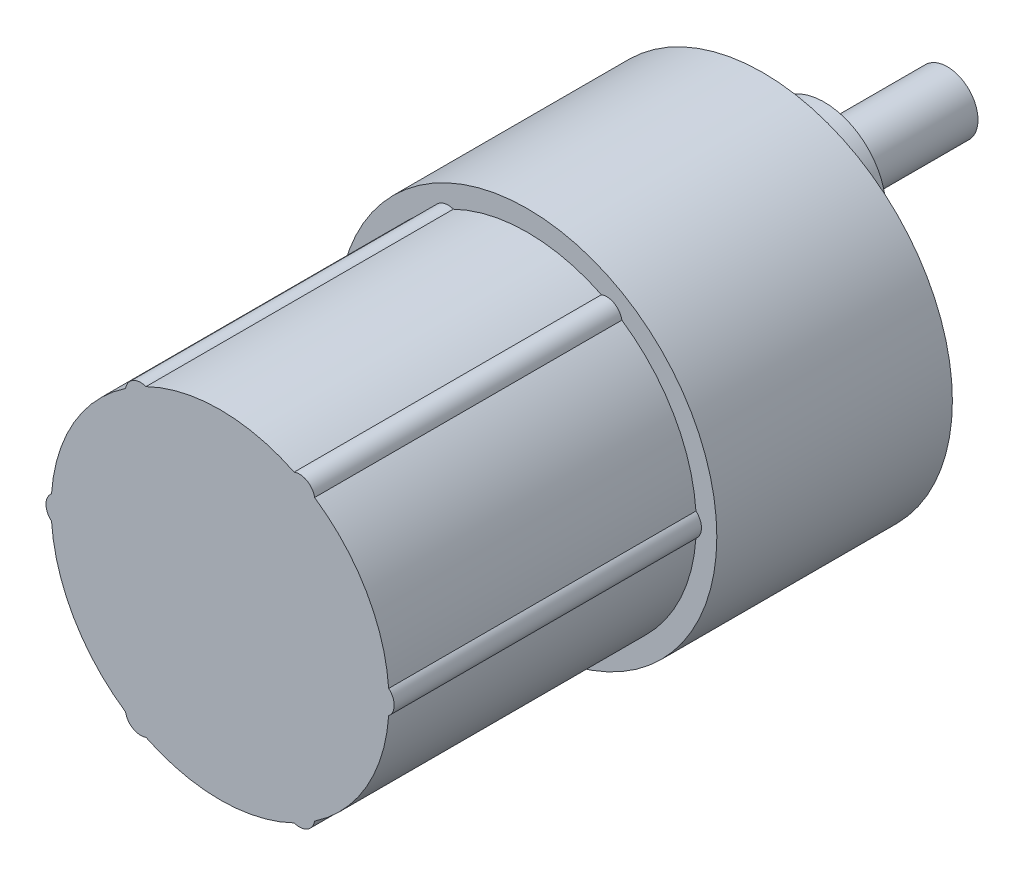
ISO-10303-21;
HEADER;
FILE_DESCRIPTION(('STEP AP214'),'2;1');
FILE_NAME('part.step','',(''),(''),'','','');
FILE_SCHEMA(('AUTOMOTIVE_DESIGN { 1 0 10303 214 1 1 1 1 }'));
ENDSEC;
DATA;
#1=APPLICATION_CONTEXT('core data for automotive mechanical design processes');
#2=APPLICATION_PROTOCOL_DEFINITION('international standard','automotive_design',2000,#1);
#3=PRODUCT_CONTEXT('',#1,'mechanical');
#4=PRODUCT('Part','Part','',(#3));
#5=PRODUCT_RELATED_PRODUCT_CATEGORY('part','',(#4));
#6=PRODUCT_DEFINITION_FORMATION('','',#4);
#7=PRODUCT_DEFINITION_CONTEXT('part definition',#1,'design');
#8=PRODUCT_DEFINITION('design','',#6,#7);
#9=PRODUCT_DEFINITION_SHAPE('','',#8);
#10=(LENGTH_UNIT() NAMED_UNIT(*) SI_UNIT(.MILLI.,.METRE.));
#11=(NAMED_UNIT(*) PLANE_ANGLE_UNIT() SI_UNIT($,.RADIAN.));
#12=(NAMED_UNIT(*) SI_UNIT($,.STERADIAN.) SOLID_ANGLE_UNIT());
#13=UNCERTAINTY_MEASURE_WITH_UNIT(LENGTH_MEASURE(1.E-05),#10,'distance_accuracy_value','');
#14=(GEOMETRIC_REPRESENTATION_CONTEXT(3) GLOBAL_UNCERTAINTY_ASSIGNED_CONTEXT((#13)) GLOBAL_UNIT_ASSIGNED_CONTEXT((#10,
#11,#12)) REPRESENTATION_CONTEXT('',''));
#15=CARTESIAN_POINT('',(0.,0.,0.));
#16=DIRECTION('',(0.,0.,1.));
#17=DIRECTION('',(1.,0.,0.));
#18=AXIS2_PLACEMENT_3D('',#15,#16,#17);
#19=CARTESIAN_POINT('',(0.,0.,23.));
#20=DIRECTION('',(0.,0.,1.));
#21=DIRECTION('',(1.,0.,0.));
#22=AXIS2_PLACEMENT_3D('',#19,#20,#21);
#23=PLANE('',#22);
#24=CARTESIAN_POINT('',(0.,0.,23.));
#25=DIRECTION('',(0.,0.,1.));
#26=DIRECTION('',(1.,0.,0.));
#27=AXIS2_PLACEMENT_3D('',#24,#25,#26);
#28=CIRCLE('',#27,18.5);
#29=CARTESIAN_POINT('',(18.5,0.,23.));
#30=VERTEX_POINT('',#29);
#31=EDGE_CURVE('E12',#30,#30,#28,.T.);
#32=ORIENTED_EDGE('',*,*,#31,.T.);
#33=EDGE_LOOP('',(#32));
#34=FACE_BOUND('',#33,.T.);
#35=CARTESIAN_POINT('',(15.5,-1.08235921504137E-13,23.));
#36=DIRECTION('',(0.,0.,1.));
#37=DIRECTION('',(1.,0.,0.));
#38=AXIS2_PLACEMENT_3D('',#35,#36,#37);
#39=CIRCLE('',#38,1.5);
#40=CARTESIAN_POINT('',(16.4596774193548,1.15283097233731,23.));
#41=VERTEX_POINT('',#40);
#42=CARTESIAN_POINT('',(16.4596774193548,-1.15283097233755,23.));
#43=VERTEX_POINT('',#42);
#44=EDGE_CURVE('E225',#41,#43,#39,.F.);
#45=ORIENTED_EDGE('',*,*,#44,.T.);
#46=CARTESIAN_POINT('',(0.,0.,23.));
#47=DIRECTION('',(0.,0.,1.));
#48=DIRECTION('',(1.,0.,0.));
#49=AXIS2_PLACEMENT_3D('',#46,#47,#48);
#50=CIRCLE('',#49,16.5);
#51=CARTESIAN_POINT('',(9.22821961799101,-13.6780832970898,23.));
#52=VERTEX_POINT('',#51);
#53=EDGE_CURVE('E106',#43,#52,#50,.F.);
#54=ORIENTED_EDGE('',*,*,#53,.T.);
#55=CARTESIAN_POINT('',(7.74999999999987,-13.4233937586589,23.));
#56=DIRECTION('',(0.,0.,1.));
#57=DIRECTION('',(1.,0.,0.));
#58=AXIS2_PLACEMENT_3D('',#55,#56,#57);
#59=CIRCLE('',#58,1.5);
#60=CARTESIAN_POINT('',(7.23145780136356,-14.8309142694272,23.));
#61=VERTEX_POINT('',#60);
#62=EDGE_CURVE('E99',#61,#52,#59,.T.);
#63=ORIENTED_EDGE('',*,*,#62,.F.);
#64=CARTESIAN_POINT('',(0.,0.,23.));
#65=DIRECTION('',(0.,0.,1.));
#66=DIRECTION('',(1.,0.,0.));
#67=AXIS2_PLACEMENT_3D('',#64,#65,#66);
#68=CIRCLE('',#67,16.5);
#69=CARTESIAN_POINT('',(-7.23145780136389,-14.830914269427,23.));
#70=VERTEX_POINT('',#69);
#71=EDGE_CURVE('E227',#61,#70,#68,.F.);
#72=ORIENTED_EDGE('',*,*,#71,.T.);
#73=CARTESIAN_POINT('',(-7.75000000000016,-13.4233937586587,23.));
#74=DIRECTION('',(0.,0.,1.));
#75=DIRECTION('',(1.,0.,0.));
#76=AXIS2_PLACEMENT_3D('',#73,#74,#75);
#77=CIRCLE('',#76,1.5);
#78=CARTESIAN_POINT('',(-9.2282196179913,-13.6780832970896,23.));
#79=VERTEX_POINT('',#78);
#80=EDGE_CURVE('E249',#79,#70,#77,.T.);
#81=ORIENTED_EDGE('',*,*,#80,.F.);
#82=CARTESIAN_POINT('',(0.,0.,23.));
#83=DIRECTION('',(0.,0.,1.));
#84=DIRECTION('',(1.,0.,0.));
#85=AXIS2_PLACEMENT_3D('',#82,#83,#84);
#86=CIRCLE('',#85,16.5);
#87=CARTESIAN_POINT('',(-16.4596774193548,-1.15283097233742,23.));
#88=VERTEX_POINT('',#87);
#89=EDGE_CURVE('E229',#79,#88,#86,.F.);
#90=ORIENTED_EDGE('',*,*,#89,.T.);
#91=CARTESIAN_POINT('',(-15.5,0.,23.));
#92=DIRECTION('',(0.,0.,1.));
#93=DIRECTION('',(1.,0.,0.));
#94=AXIS2_PLACEMENT_3D('',#91,#92,#93);
#95=CIRCLE('',#94,1.5);
#96=CARTESIAN_POINT('',(-16.4596774193548,1.15283097233743,23.));
#97=VERTEX_POINT('',#96);
#98=EDGE_CURVE('E252',#97,#88,#95,.T.);
#99=ORIENTED_EDGE('',*,*,#98,.F.);
#100=CARTESIAN_POINT('',(0.,0.,23.));
#101=DIRECTION('',(0.,0.,1.));
#102=DIRECTION('',(1.,0.,0.));
#103=AXIS2_PLACEMENT_3D('',#100,#101,#102);
#104=CIRCLE('',#103,16.5);
#105=CARTESIAN_POINT('',(-9.22821961799111,13.6780832970897,23.));
#106=VERTEX_POINT('',#105);
#107=EDGE_CURVE('E231',#97,#106,#104,.F.);
#108=ORIENTED_EDGE('',*,*,#107,.T.);
#109=CARTESIAN_POINT('',(-7.74999999999997,13.4233937586588,23.));
#110=DIRECTION('',(0.,0.,1.));
#111=DIRECTION('',(1.,0.,0.));
#112=AXIS2_PLACEMENT_3D('',#109,#110,#111);
#113=CIRCLE('',#112,1.5);
#114=CARTESIAN_POINT('',(-7.23145780136368,14.8309142694271,23.));
#115=VERTEX_POINT('',#114);
#116=EDGE_CURVE('E255',#115,#106,#113,.T.);
#117=ORIENTED_EDGE('',*,*,#116,.F.);
#118=CARTESIAN_POINT('',(0.,0.,23.));
#119=DIRECTION('',(0.,0.,1.));
#120=DIRECTION('',(1.,0.,0.));
#121=AXIS2_PLACEMENT_3D('',#118,#119,#120);
#122=CIRCLE('',#121,16.5);
#123=CARTESIAN_POINT('',(7.23145780136377,14.8309142694271,23.));
#124=VERTEX_POINT('',#123);
#125=EDGE_CURVE('E203',#115,#124,#122,.F.);
#126=ORIENTED_EDGE('',*,*,#125,.T.);
#127=CARTESIAN_POINT('',(7.75000000000006,13.4233937586588,23.));
#128=DIRECTION('',(0.,0.,1.));
#129=DIRECTION('',(1.,0.,0.));
#130=AXIS2_PLACEMENT_3D('',#127,#128,#129);
#131=CIRCLE('',#130,1.5);
#132=CARTESIAN_POINT('',(9.22821961799121,13.6780832970896,23.));
#133=VERTEX_POINT('',#132);
#134=EDGE_CURVE('E257',#133,#124,#131,.T.);
#135=ORIENTED_EDGE('',*,*,#134,.F.);
#136=CARTESIAN_POINT('',(0.,0.,23.));
#137=DIRECTION('',(0.,0.,1.));
#138=DIRECTION('',(1.,0.,0.));
#139=AXIS2_PLACEMENT_3D('',#136,#137,#138);
#140=CIRCLE('',#139,16.5);
#141=EDGE_CURVE('E234',#133,#41,#140,.F.);
#142=ORIENTED_EDGE('',*,*,#141,.T.);
#143=EDGE_LOOP('',(#45,#54,#63,#72,#81,#90,#99,#108,#117,#126,#135,#142));
#144=FACE_BOUND('',#143,.T.);
#145=ADVANCED_FACE('F90',(#34,#144),#23,.T.);
#146=CARTESIAN_POINT('',(0.,0.,23.));
#147=DIRECTION('',(0.,0.,-1.));
#148=DIRECTION('',(-1.,0.,0.));
#149=AXIS2_PLACEMENT_3D('',#146,#147,#148);
#150=CYLINDRICAL_SURFACE('',#149,18.5);
#151=ORIENTED_EDGE('',*,*,#31,.F.);
#152=EDGE_LOOP('',(#151));
#153=FACE_BOUND('',#152,.T.);
#154=CARTESIAN_POINT('',(0.,0.,0.));
#155=DIRECTION('',(0.,0.,1.));
#156=DIRECTION('',(1.,0.,0.));
#157=AXIS2_PLACEMENT_3D('',#154,#155,#156);
#158=CIRCLE('',#157,18.5);
#159=CARTESIAN_POINT('',(18.5,0.,0.));
#160=VERTEX_POINT('',#159);
#161=EDGE_CURVE('E94',#160,#160,#158,.T.);
#162=ORIENTED_EDGE('',*,*,#161,.T.);
#163=EDGE_LOOP('',(#162));
#164=FACE_BOUND('',#163,.T.);
#165=ADVANCED_FACE('F92',(#153,#164),#150,.T.);
#166=CARTESIAN_POINT('',(0.,0.,0.));
#167=DIRECTION('',(0.,0.,1.));
#168=DIRECTION('',(1.,0.,0.));
#169=AXIS2_PLACEMENT_3D('',#166,#167,#168);
#170=PLANE('',#169);
#171=CARTESIAN_POINT('',(7.75000000000006,13.4233937586588,0.));
#172=DIRECTION('',(0.,0.,1.));
#173=DIRECTION('',(1.,0.,0.));
#174=AXIS2_PLACEMENT_3D('',#171,#172,#173);
#175=CIRCLE('',#174,1.5);
#176=CARTESIAN_POINT('',(9.25000000000006,13.4233937586588,0.));
#177=VERTEX_POINT('',#176);
#178=EDGE_CURVE('E354',#177,#177,#175,.T.);
#179=ORIENTED_EDGE('',*,*,#178,.T.);
#180=EDGE_LOOP('',(#179));
#181=FACE_BOUND('',#180,.T.);
#182=CARTESIAN_POINT('',(-7.74999999999997,13.4233937586588,0.));
#183=DIRECTION('',(0.,0.,1.));
#184=DIRECTION('',(1.,0.,0.));
#185=AXIS2_PLACEMENT_3D('',#182,#183,#184);
#186=CIRCLE('',#185,1.5);
#187=CARTESIAN_POINT('',(-6.24999999999997,13.4233937586588,0.));
#188=VERTEX_POINT('',#187);
#189=EDGE_CURVE('E358',#188,#188,#186,.T.);
#190=ORIENTED_EDGE('',*,*,#189,.T.);
#191=EDGE_LOOP('',(#190));
#192=FACE_BOUND('',#191,.T.);
#193=CARTESIAN_POINT('',(7.74999999999987,-13.4233937586589,0.));
#194=DIRECTION('',(0.,0.,1.));
#195=DIRECTION('',(1.,0.,0.));
#196=AXIS2_PLACEMENT_3D('',#193,#194,#195);
#197=CIRCLE('',#196,1.5);
#198=CARTESIAN_POINT('',(9.24999999999988,-13.4233937586589,0.));
#199=VERTEX_POINT('',#198);
#200=EDGE_CURVE('E362',#199,#199,#197,.T.);
#201=ORIENTED_EDGE('',*,*,#200,.T.);
#202=EDGE_LOOP('',(#201));
#203=FACE_BOUND('',#202,.T.);
#204=CARTESIAN_POINT('',(-15.5,0.,0.));
#205=DIRECTION('',(0.,0.,1.));
#206=DIRECTION('',(1.,0.,0.));
#207=AXIS2_PLACEMENT_3D('',#204,#205,#206);
#208=CIRCLE('',#207,1.5);
#209=CARTESIAN_POINT('',(-14.,0.,0.));
#210=VERTEX_POINT('',#209);
#211=EDGE_CURVE('E366',#210,#210,#208,.T.);
#212=ORIENTED_EDGE('',*,*,#211,.T.);
#213=EDGE_LOOP('',(#212));
#214=FACE_BOUND('',#213,.T.);
#215=CARTESIAN_POINT('',(-7.75000000000016,-13.4233937586587,0.));
#216=DIRECTION('',(0.,0.,1.));
#217=DIRECTION('',(1.,0.,0.));
#218=AXIS2_PLACEMENT_3D('',#215,#216,#217);
#219=CIRCLE('',#218,1.5);
#220=CARTESIAN_POINT('',(-6.25000000000015,-13.4233937586587,0.));
#221=VERTEX_POINT('',#220);
#222=EDGE_CURVE('E370',#221,#221,#219,.T.);
#223=ORIENTED_EDGE('',*,*,#222,.T.);
#224=EDGE_LOOP('',(#223));
#225=FACE_BOUND('',#224,.T.);
#226=CARTESIAN_POINT('',(15.5,-1.08235921504137E-13,0.));
#227=DIRECTION('',(0.,0.,1.));
#228=DIRECTION('',(1.,0.,0.));
#229=AXIS2_PLACEMENT_3D('',#226,#227,#228);
#230=CIRCLE('',#229,1.5);
#231=CARTESIAN_POINT('',(17.,-1.08235921504137E-13,0.));
#232=VERTEX_POINT('',#231);
#233=EDGE_CURVE('E374',#232,#232,#230,.T.);
#234=ORIENTED_EDGE('',*,*,#233,.T.);
#235=EDGE_LOOP('',(#234));
#236=FACE_BOUND('',#235,.T.);
#237=CARTESIAN_POINT('',(0.,7.,0.));
#238=DIRECTION('',(0.,0.,1.));
#239=DIRECTION('',(1.,0.,0.));
#240=AXIS2_PLACEMENT_3D('',#237,#238,#239);
#241=CIRCLE('',#240,6.);
#242=CARTESIAN_POINT('',(6.,7.,0.));
#243=VERTEX_POINT('',#242);
#244=EDGE_CURVE('E243',#243,#243,#241,.T.);
#245=ORIENTED_EDGE('',*,*,#244,.T.);
#246=EDGE_LOOP('',(#245));
#247=FACE_BOUND('',#246,.T.);
#248=ORIENTED_EDGE('',*,*,#161,.F.);
#249=EDGE_LOOP('',(#248));
#250=FACE_BOUND('',#249,.T.);
#251=ADVANCED_FACE('F339',(#181,#192,#203,#214,#225,#236,#247,#250),#170,.F.);
#252=CARTESIAN_POINT('',(0.,7.,-6.));
#253=DIRECTION('',(0.,0.,1.));
#254=DIRECTION('',(1.,0.,0.));
#255=AXIS2_PLACEMENT_3D('',#252,#253,#254);
#256=CYLINDRICAL_SURFACE('',#255,6.);
#257=CARTESIAN_POINT('',(0.,7.,-6.));
#258=DIRECTION('',(0.,0.,1.));
#259=DIRECTION('',(1.,0.,0.));
#260=AXIS2_PLACEMENT_3D('',#257,#258,#259);
#261=CIRCLE('',#260,6.);
#262=CARTESIAN_POINT('',(6.,7.,-6.));
#263=VERTEX_POINT('',#262);
#264=EDGE_CURVE('E244',#263,#263,#261,.T.);
#265=ORIENTED_EDGE('',*,*,#264,.T.);
#266=EDGE_LOOP('',(#265));
#267=FACE_BOUND('',#266,.T.);
#268=ORIENTED_EDGE('',*,*,#244,.F.);
#269=EDGE_LOOP('',(#268));
#270=FACE_BOUND('',#269,.T.);
#271=ADVANCED_FACE('F342',(#267,#270),#256,.T.);
#272=CARTESIAN_POINT('',(0.,0.,-6.));
#273=DIRECTION('',(0.,0.,1.));
#274=DIRECTION('',(1.,0.,0.));
#275=AXIS2_PLACEMENT_3D('',#272,#273,#274);
#276=PLANE('',#275);
#277=CARTESIAN_POINT('',(0.,7.,-6.));
#278=DIRECTION('',(0.,0.,1.));
#279=DIRECTION('',(1.,0.,0.));
#280=AXIS2_PLACEMENT_3D('',#277,#278,#279);
#281=CIRCLE('',#280,3.);
#282=CARTESIAN_POINT('',(3.,7.,-6.));
#283=VERTEX_POINT('',#282);
#284=EDGE_CURVE('E240',#283,#283,#281,.T.);
#285=ORIENTED_EDGE('',*,*,#284,.T.);
#286=EDGE_LOOP('',(#285));
#287=FACE_BOUND('',#286,.T.);
#288=ORIENTED_EDGE('',*,*,#264,.F.);
#289=EDGE_LOOP('',(#288));
#290=FACE_BOUND('',#289,.T.);
#291=ADVANCED_FACE('F349',(#287,#290),#276,.F.);
#292=CARTESIAN_POINT('',(0.,7.,-18.));
#293=DIRECTION('',(0.,0.,1.));
#294=DIRECTION('',(1.,0.,0.));
#295=AXIS2_PLACEMENT_3D('',#292,#293,#294);
#296=CYLINDRICAL_SURFACE('',#295,3.);
#297=CARTESIAN_POINT('',(0.,7.,-18.));
#298=DIRECTION('',(0.,0.,1.));
#299=DIRECTION('',(1.,0.,0.));
#300=AXIS2_PLACEMENT_3D('',#297,#298,#299);
#301=CIRCLE('',#300,3.);
#302=CARTESIAN_POINT('',(3.,7.,-18.));
#303=VERTEX_POINT('',#302);
#304=EDGE_CURVE('E237',#303,#303,#301,.T.);
#305=ORIENTED_EDGE('',*,*,#304,.T.);
#306=EDGE_LOOP('',(#305));
#307=FACE_BOUND('',#306,.T.);
#308=ORIENTED_EDGE('',*,*,#284,.F.);
#309=EDGE_LOOP('',(#308));
#310=FACE_BOUND('',#309,.T.);
#311=ADVANCED_FACE('F679',(#307,#310),#296,.T.);
#312=CARTESIAN_POINT('',(0.,0.,-18.));
#313=DIRECTION('',(0.,0.,1.));
#314=DIRECTION('',(1.,0.,0.));
#315=AXIS2_PLACEMENT_3D('',#312,#313,#314);
#316=PLANE('',#315);
#317=ORIENTED_EDGE('',*,*,#304,.F.);
#318=EDGE_LOOP('',(#317));
#319=FACE_BOUND('',#318,.T.);
#320=ADVANCED_FACE('F462',(#319),#316,.F.);
#321=CARTESIAN_POINT('',(7.74999999999987,-13.4233937586589,53.));
#322=DIRECTION('',(0.,0.,-1.));
#323=DIRECTION('',(-1.,0.,0.));
#324=AXIS2_PLACEMENT_3D('',#321,#322,#323);
#325=CYLINDRICAL_SURFACE('',#324,1.5);
#326=ORIENTED_EDGE('',*,*,#62,.T.);
#327=DIRECTION('',(0.,0.,-1.));
#328=VECTOR('',#327,1.);
#329=CARTESIAN_POINT('',(9.22821961799103,-13.6780832970897,53.));
#330=LINE('',#329,#328);
#331=CARTESIAN_POINT('',(9.22821961799103,-13.6780832970897,53.));
#332=VERTEX_POINT('',#331);
#333=EDGE_CURVE('E266',#332,#52,#330,.T.);
#334=ORIENTED_EDGE('',*,*,#333,.F.);
#335=CARTESIAN_POINT('',(7.74999999999987,-13.4233937586589,53.));
#336=DIRECTION('',(0.,0.,1.));
#337=DIRECTION('',(1.,0.,0.));
#338=AXIS2_PLACEMENT_3D('',#335,#336,#337);
#339=CIRCLE('',#338,1.5);
#340=CARTESIAN_POINT('',(7.23145780136354,-14.8309142694272,53.));
#341=VERTEX_POINT('',#340);
#342=EDGE_CURVE('E304',#341,#332,#339,.T.);
#343=ORIENTED_EDGE('',*,*,#342,.F.);
#344=DIRECTION('',(0.,0.,-1.));
#345=VECTOR('',#344,1.);
#346=CARTESIAN_POINT('',(7.23145780136354,-14.8309142694272,53.));
#347=LINE('',#346,#345);
#348=EDGE_CURVE('E269',#341,#61,#347,.T.);
#349=ORIENTED_EDGE('',*,*,#348,.T.);
#350=EDGE_LOOP('',(#326,#334,#343,#349));
#351=FACE_BOUND('',#350,.T.);
#352=ADVANCED_FACE('F264',(#351),#325,.T.);
#353=CARTESIAN_POINT('',(0.,0.,53.));
#354=DIRECTION('',(0.,0.,-1.));
#355=DIRECTION('',(-1.,0.,0.));
#356=AXIS2_PLACEMENT_3D('',#353,#354,#355);
#357=CYLINDRICAL_SURFACE('',#356,16.5);
#358=ORIENTED_EDGE('',*,*,#53,.F.);
#359=DIRECTION('',(0.,0.,-1.));
#360=VECTOR('',#359,1.);
#361=CARTESIAN_POINT('',(16.4596774193548,-1.15283097233755,26.5));
#362=LINE('',#361,#360);
#363=CARTESIAN_POINT('',(16.4596774193548,-1.15283097233756,53.));
#364=VERTEX_POINT('',#363);
#365=EDGE_CURVE('E206',#364,#43,#362,.T.);
#366=ORIENTED_EDGE('',*,*,#365,.F.);
#367=CARTESIAN_POINT('',(0.,0.,53.));
#368=DIRECTION('',(0.,0.,1.));
#369=DIRECTION('',(1.,0.,0.));
#370=AXIS2_PLACEMENT_3D('',#367,#368,#369);
#371=CIRCLE('',#370,16.5);
#372=EDGE_CURVE('E273',#332,#364,#371,.T.);
#373=ORIENTED_EDGE('',*,*,#372,.F.);
#374=ORIENTED_EDGE('',*,*,#333,.T.);
#375=EDGE_LOOP('',(#358,#366,#373,#374));
#376=FACE_BOUND('',#375,.T.);
#377=ADVANCED_FACE('F271',(#376),#357,.T.);
#378=ORIENTED_EDGE('',*,*,#141,.F.);
#379=DIRECTION('',(0.,0.,-1.));
#380=VECTOR('',#379,1.);
#381=CARTESIAN_POINT('',(9.22821961799122,13.6780832970896,53.));
#382=LINE('',#381,#380);
#383=CARTESIAN_POINT('',(9.22821961799122,13.6780832970896,53.));
#384=VERTEX_POINT('',#383);
#385=EDGE_CURVE('E274',#384,#133,#382,.T.);
#386=ORIENTED_EDGE('',*,*,#385,.F.);
#387=CARTESIAN_POINT('',(16.4596774193548,1.15283097233733,53.));
#388=VERTEX_POINT('',#387);
#389=EDGE_CURVE('E200',#388,#384,#371,.T.);
#390=ORIENTED_EDGE('',*,*,#389,.F.);
#391=DIRECTION('',(0.,0.,-1.));
#392=VECTOR('',#391,1.);
#393=CARTESIAN_POINT('',(16.4596774193548,1.15283097233731,26.5));
#394=LINE('',#393,#392);
#395=EDGE_CURVE('E204',#41,#388,#394,.F.);
#396=ORIENTED_EDGE('',*,*,#395,.F.);
#397=EDGE_LOOP('',(#378,#386,#390,#396));
#398=FACE_BOUND('',#397,.T.);
#399=ADVANCED_FACE('F315',(#398),#357,.T.);
#400=CARTESIAN_POINT('',(7.75000000000006,13.4233937586588,53.));
#401=DIRECTION('',(0.,0.,-1.));
#402=DIRECTION('',(-1.,0.,0.));
#403=AXIS2_PLACEMENT_3D('',#400,#401,#402);
#404=CYLINDRICAL_SURFACE('',#403,1.5);
#405=ORIENTED_EDGE('',*,*,#134,.T.);
#406=DIRECTION('',(0.,0.,-1.));
#407=VECTOR('',#406,1.);
#408=CARTESIAN_POINT('',(7.23145780136375,14.8309142694271,53.));
#409=LINE('',#408,#407);
#410=CARTESIAN_POINT('',(7.23145780136375,14.8309142694271,53.));
#411=VERTEX_POINT('',#410);
#412=EDGE_CURVE('E279',#411,#124,#409,.T.);
#413=ORIENTED_EDGE('',*,*,#412,.F.);
#414=CARTESIAN_POINT('',(7.75000000000006,13.4233937586588,53.));
#415=DIRECTION('',(0.,0.,1.));
#416=DIRECTION('',(1.,0.,0.));
#417=AXIS2_PLACEMENT_3D('',#414,#415,#416);
#418=CIRCLE('',#417,1.5);
#419=EDGE_CURVE('E194',#384,#411,#418,.T.);
#420=ORIENTED_EDGE('',*,*,#419,.F.);
#421=ORIENTED_EDGE('',*,*,#385,.T.);
#422=EDGE_LOOP('',(#405,#413,#420,#421));
#423=FACE_BOUND('',#422,.T.);
#424=ADVANCED_FACE('F317',(#423),#404,.T.);
#425=ORIENTED_EDGE('',*,*,#125,.F.);
#426=DIRECTION('',(0.,0.,-1.));
#427=VECTOR('',#426,1.);
#428=CARTESIAN_POINT('',(-7.23145780136369,14.8309142694271,53.));
#429=LINE('',#428,#427);
#430=CARTESIAN_POINT('',(-7.23145780136369,14.8309142694271,53.));
#431=VERTEX_POINT('',#430);
#432=EDGE_CURVE('E182',#431,#115,#429,.T.);
#433=ORIENTED_EDGE('',*,*,#432,.F.);
#434=EDGE_CURVE('E188',#411,#431,#371,.T.);
#435=ORIENTED_EDGE('',*,*,#434,.F.);
#436=ORIENTED_EDGE('',*,*,#412,.T.);
#437=EDGE_LOOP('',(#425,#433,#435,#436));
#438=FACE_BOUND('',#437,.T.);
#439=ADVANCED_FACE('F202',(#438),#357,.T.);
#440=CARTESIAN_POINT('',(-7.74999999999997,13.4233937586588,53.));
#441=DIRECTION('',(0.,0.,-1.));
#442=DIRECTION('',(-1.,0.,0.));
#443=AXIS2_PLACEMENT_3D('',#440,#441,#442);
#444=CYLINDRICAL_SURFACE('',#443,1.5);
#445=ORIENTED_EDGE('',*,*,#116,.T.);
#446=DIRECTION('',(0.,0.,-1.));
#447=VECTOR('',#446,1.);
#448=CARTESIAN_POINT('',(-9.22821961799109,13.6780832970897,53.));
#449=LINE('',#448,#447);
#450=CARTESIAN_POINT('',(-9.22821961799109,13.6780832970897,53.));
#451=VERTEX_POINT('',#450);
#452=EDGE_CURVE('E184',#451,#106,#449,.T.);
#453=ORIENTED_EDGE('',*,*,#452,.F.);
#454=CARTESIAN_POINT('',(-7.74999999999997,13.4233937586588,53.));
#455=DIRECTION('',(0.,0.,1.));
#456=DIRECTION('',(1.,0.,0.));
#457=AXIS2_PLACEMENT_3D('',#454,#455,#456);
#458=CIRCLE('',#457,1.5);
#459=EDGE_CURVE('E177',#431,#451,#458,.T.);
#460=ORIENTED_EDGE('',*,*,#459,.F.);
#461=ORIENTED_EDGE('',*,*,#432,.T.);
#462=EDGE_LOOP('',(#445,#453,#460,#461));
#463=FACE_BOUND('',#462,.T.);
#464=ADVANCED_FACE('F180',(#463),#444,.T.);
#465=ORIENTED_EDGE('',*,*,#107,.F.);
#466=DIRECTION('',(0.,0.,-1.));
#467=VECTOR('',#466,1.);
#468=CARTESIAN_POINT('',(-16.4596774193548,1.15283097233744,53.));
#469=LINE('',#468,#467);
#470=CARTESIAN_POINT('',(-16.4596774193548,1.15283097233744,53.));
#471=VERTEX_POINT('',#470);
#472=EDGE_CURVE('E208',#471,#97,#469,.T.);
#473=ORIENTED_EDGE('',*,*,#472,.F.);
#474=EDGE_CURVE('E187',#451,#471,#371,.T.);
#475=ORIENTED_EDGE('',*,*,#474,.F.);
#476=ORIENTED_EDGE('',*,*,#452,.T.);
#477=EDGE_LOOP('',(#465,#473,#475,#476));
#478=FACE_BOUND('',#477,.T.);
#479=ADVANCED_FACE('F293',(#478),#357,.T.);
#480=CARTESIAN_POINT('',(-15.5,0.,53.));
#481=DIRECTION('',(0.,0.,-1.));
#482=DIRECTION('',(-1.,0.,0.));
#483=AXIS2_PLACEMENT_3D('',#480,#481,#482);
#484=CYLINDRICAL_SURFACE('',#483,1.5);
#485=ORIENTED_EDGE('',*,*,#98,.T.);
#486=DIRECTION('',(0.,0.,-1.));
#487=VECTOR('',#486,1.);
#488=CARTESIAN_POINT('',(-16.4596774193548,-1.15283097233744,53.));
#489=LINE('',#488,#487);
#490=CARTESIAN_POINT('',(-16.4596774193548,-1.15283097233744,53.));
#491=VERTEX_POINT('',#490);
#492=EDGE_CURVE('E276',#491,#88,#489,.T.);
#493=ORIENTED_EDGE('',*,*,#492,.F.);
#494=CARTESIAN_POINT('',(-15.5,0.,53.));
#495=DIRECTION('',(0.,0.,1.));
#496=DIRECTION('',(1.,0.,0.));
#497=AXIS2_PLACEMENT_3D('',#494,#495,#496);
#498=CIRCLE('',#497,1.5);
#499=EDGE_CURVE('E290',#471,#491,#498,.T.);
#500=ORIENTED_EDGE('',*,*,#499,.F.);
#501=ORIENTED_EDGE('',*,*,#472,.T.);
#502=EDGE_LOOP('',(#485,#493,#500,#501));
#503=FACE_BOUND('',#502,.T.);
#504=ADVANCED_FACE('F288',(#503),#484,.T.);
#505=ORIENTED_EDGE('',*,*,#89,.F.);
#506=DIRECTION('',(0.,0.,-1.));
#507=VECTOR('',#506,1.);
#508=CARTESIAN_POINT('',(-9.2282196179913,-13.6780832970896,26.5));
#509=LINE('',#508,#507);
#510=CARTESIAN_POINT('',(-9.22821961799128,-13.6780832970896,53.));
#511=VERTEX_POINT('',#510);
#512=EDGE_CURVE('E222',#511,#79,#509,.T.);
#513=ORIENTED_EDGE('',*,*,#512,.F.);
#514=EDGE_CURVE('E303',#491,#511,#371,.T.);
#515=ORIENTED_EDGE('',*,*,#514,.F.);
#516=ORIENTED_EDGE('',*,*,#492,.T.);
#517=EDGE_LOOP('',(#505,#513,#515,#516));
#518=FACE_BOUND('',#517,.T.);
#519=ADVANCED_FACE('F296',(#518),#357,.T.);
#520=ORIENTED_EDGE('',*,*,#71,.F.);
#521=ORIENTED_EDGE('',*,*,#348,.F.);
#522=CARTESIAN_POINT('',(-7.23145780136389,-14.830914269427,53.));
#523=VERTEX_POINT('',#522);
#524=EDGE_CURVE('E305',#523,#341,#371,.T.);
#525=ORIENTED_EDGE('',*,*,#524,.F.);
#526=DIRECTION('',(0.,0.,-1.));
#527=VECTOR('',#526,1.);
#528=CARTESIAN_POINT('',(-7.23145780136389,-14.830914269427,26.5));
#529=LINE('',#528,#527);
#530=EDGE_CURVE('E220',#70,#523,#529,.F.);
#531=ORIENTED_EDGE('',*,*,#530,.F.);
#532=EDGE_LOOP('',(#520,#521,#525,#531));
#533=FACE_BOUND('',#532,.T.);
#534=ADVANCED_FACE('F330',(#533),#357,.T.);
#535=CARTESIAN_POINT('',(0.,0.,53.));
#536=DIRECTION('',(0.,0.,1.));
#537=DIRECTION('',(1.,0.,0.));
#538=AXIS2_PLACEMENT_3D('',#535,#536,#537);
#539=PLANE('',#538);
#540=ORIENTED_EDGE('',*,*,#514,.T.);
#541=CARTESIAN_POINT('',(-7.75000000000016,-13.4233937586587,53.));
#542=DIRECTION('',(0.,0.,1.));
#543=DIRECTION('',(1.,0.,0.));
#544=AXIS2_PLACEMENT_3D('',#541,#542,#543);
#545=CIRCLE('',#544,1.5);
#546=EDGE_CURVE('E198',#511,#523,#545,.T.);
#547=ORIENTED_EDGE('',*,*,#546,.T.);
#548=ORIENTED_EDGE('',*,*,#524,.T.);
#549=ORIENTED_EDGE('',*,*,#342,.T.);
#550=ORIENTED_EDGE('',*,*,#372,.T.);
#551=CARTESIAN_POINT('',(15.5,-1.08235921504137E-13,53.));
#552=DIRECTION('',(0.,0.,1.));
#553=DIRECTION('',(1.,0.,0.));
#554=AXIS2_PLACEMENT_3D('',#551,#552,#553);
#555=CIRCLE('',#554,1.5);
#556=EDGE_CURVE('E214',#364,#388,#555,.T.);
#557=ORIENTED_EDGE('',*,*,#556,.T.);
#558=ORIENTED_EDGE('',*,*,#389,.T.);
#559=ORIENTED_EDGE('',*,*,#419,.T.);
#560=ORIENTED_EDGE('',*,*,#434,.T.);
#561=ORIENTED_EDGE('',*,*,#459,.T.);
#562=ORIENTED_EDGE('',*,*,#474,.T.);
#563=ORIENTED_EDGE('',*,*,#499,.T.);
#564=EDGE_LOOP('',(#540,#547,#548,#549,#550,#557,#558,#559,#560,#561,#562,#563));
#565=FACE_BOUND('',#564,.T.);
#566=ADVANCED_FACE('F192',(#565),#539,.T.);
#567=CARTESIAN_POINT('',(15.5,-1.08235921504137E-13,53.));
#568=DIRECTION('',(0.,0.,-1.));
#569=DIRECTION('',(-1.,0.,0.));
#570=AXIS2_PLACEMENT_3D('',#567,#568,#569);
#571=CYLINDRICAL_SURFACE('',#570,1.5);
#572=ORIENTED_EDGE('',*,*,#44,.F.);
#573=ORIENTED_EDGE('',*,*,#395,.T.);
#574=ORIENTED_EDGE('',*,*,#556,.F.);
#575=ORIENTED_EDGE('',*,*,#365,.T.);
#576=EDGE_LOOP('',(#572,#573,#574,#575));
#577=FACE_BOUND('',#576,.T.);
#578=ADVANCED_FACE('F321',(#577),#571,.T.);
#579=CARTESIAN_POINT('',(-7.75000000000016,-13.4233937586587,53.));
#580=DIRECTION('',(0.,0.,-1.));
#581=DIRECTION('',(-1.,0.,0.));
#582=AXIS2_PLACEMENT_3D('',#579,#580,#581);
#583=CYLINDRICAL_SURFACE('',#582,1.5);
#584=ORIENTED_EDGE('',*,*,#80,.T.);
#585=ORIENTED_EDGE('',*,*,#530,.T.);
#586=ORIENTED_EDGE('',*,*,#546,.F.);
#587=ORIENTED_EDGE('',*,*,#512,.T.);
#588=EDGE_LOOP('',(#584,#585,#586,#587));
#589=FACE_BOUND('',#588,.T.);
#590=ADVANCED_FACE('F300',(#589),#583,.T.);
#591=CARTESIAN_POINT('',(15.5,-1.08235921504137E-13,10.));
#592=DIRECTION('',(0.,0.,-1.));
#593=DIRECTION('',(-1.,0.,0.));
#594=AXIS2_PLACEMENT_3D('',#591,#592,#593);
#595=CYLINDRICAL_SURFACE('',#594,1.5);
#596=CARTESIAN_POINT('',(15.5,-1.08235921504137E-13,10.));
#597=DIRECTION('',(0.,0.,1.));
#598=DIRECTION('',(1.,0.,0.));
#599=AXIS2_PLACEMENT_3D('',#596,#597,#598);
#600=CIRCLE('',#599,1.5);
#601=CARTESIAN_POINT('',(17.,-1.08235921504137E-13,10.));
#602=VERTEX_POINT('',#601);
#603=EDGE_CURVE('E216',#602,#602,#600,.T.);
#604=ORIENTED_EDGE('',*,*,#603,.T.);
#605=EDGE_LOOP('',(#604));
#606=FACE_BOUND('',#605,.T.);
#607=ORIENTED_EDGE('',*,*,#233,.F.);
#608=EDGE_LOOP('',(#607));
#609=FACE_BOUND('',#608,.T.);
#610=ADVANCED_FACE('F328',(#606,#609),#595,.F.);
#611=CARTESIAN_POINT('',(0.,0.,10.));
#612=DIRECTION('',(0.,0.,1.));
#613=DIRECTION('',(1.,0.,0.));
#614=AXIS2_PLACEMENT_3D('',#611,#612,#613);
#615=PLANE('',#614);
#616=ORIENTED_EDGE('',*,*,#603,.F.);
#617=EDGE_LOOP('',(#616));
#618=FACE_BOUND('',#617,.T.);
#619=ADVANCED_FACE('F442',(#618),#615,.F.);
#620=CARTESIAN_POINT('',(-7.75000000000016,-13.4233937586587,10.));
#621=DIRECTION('',(0.,0.,-1.));
#622=DIRECTION('',(-1.,0.,0.));
#623=AXIS2_PLACEMENT_3D('',#620,#621,#622);
#624=CYLINDRICAL_SURFACE('',#623,1.5);
#625=CARTESIAN_POINT('',(-7.75000000000016,-13.4233937586587,10.));
#626=DIRECTION('',(0.,0.,1.));
#627=DIRECTION('',(1.,0.,0.));
#628=AXIS2_PLACEMENT_3D('',#625,#626,#627);
#629=CIRCLE('',#628,1.5);
#630=CARTESIAN_POINT('',(-6.25000000000015,-13.4233937586587,10.));
#631=VERTEX_POINT('',#630);
#632=EDGE_CURVE('E382',#631,#631,#629,.T.);
#633=ORIENTED_EDGE('',*,*,#632,.T.);
#634=EDGE_LOOP('',(#633));
#635=FACE_BOUND('',#634,.T.);
#636=ORIENTED_EDGE('',*,*,#222,.F.);
#637=EDGE_LOOP('',(#636));
#638=FACE_BOUND('',#637,.T.);
#639=ADVANCED_FACE('F438',(#635,#638),#624,.F.);
#640=CARTESIAN_POINT('',(0.,0.,10.));
#641=DIRECTION('',(0.,0.,1.));
#642=DIRECTION('',(1.,0.,0.));
#643=AXIS2_PLACEMENT_3D('',#640,#641,#642);
#644=PLANE('',#643);
#645=ORIENTED_EDGE('',*,*,#632,.F.);
#646=EDGE_LOOP('',(#645));
#647=FACE_BOUND('',#646,.T.);
#648=ADVANCED_FACE('F434',(#647),#644,.F.);
#649=CARTESIAN_POINT('',(-15.5,0.,10.));
#650=DIRECTION('',(0.,0.,-1.));
#651=DIRECTION('',(-1.,0.,0.));
#652=AXIS2_PLACEMENT_3D('',#649,#650,#651);
#653=CYLINDRICAL_SURFACE('',#652,1.5);
#654=CARTESIAN_POINT('',(-15.5,0.,10.));
#655=DIRECTION('',(0.,0.,1.));
#656=DIRECTION('',(1.,0.,0.));
#657=AXIS2_PLACEMENT_3D('',#654,#655,#656);
#658=CIRCLE('',#657,1.5);
#659=CARTESIAN_POINT('',(-14.,0.,10.));
#660=VERTEX_POINT('',#659);
#661=EDGE_CURVE('E389',#660,#660,#658,.T.);
#662=ORIENTED_EDGE('',*,*,#661,.T.);
#663=EDGE_LOOP('',(#662));
#664=FACE_BOUND('',#663,.T.);
#665=ORIENTED_EDGE('',*,*,#211,.F.);
#666=EDGE_LOOP('',(#665));
#667=FACE_BOUND('',#666,.T.);
#668=ADVANCED_FACE('F437',(#664,#667),#653,.F.);
#669=CARTESIAN_POINT('',(0.,0.,10.));
#670=DIRECTION('',(0.,0.,1.));
#671=DIRECTION('',(1.,0.,0.));
#672=AXIS2_PLACEMENT_3D('',#669,#670,#671);
#673=PLANE('',#672);
#674=ORIENTED_EDGE('',*,*,#661,.F.);
#675=EDGE_LOOP('',(#674));
#676=FACE_BOUND('',#675,.T.);
#677=ADVANCED_FACE('F429',(#676),#673,.F.);
#678=CARTESIAN_POINT('',(7.74999999999987,-13.4233937586589,10.));
#679=DIRECTION('',(0.,0.,-1.));
#680=DIRECTION('',(-1.,0.,0.));
#681=AXIS2_PLACEMENT_3D('',#678,#679,#680);
#682=CYLINDRICAL_SURFACE('',#681,1.5);
#683=CARTESIAN_POINT('',(7.74999999999987,-13.4233937586589,10.));
#684=DIRECTION('',(0.,0.,1.));
#685=DIRECTION('',(1.,0.,0.));
#686=AXIS2_PLACEMENT_3D('',#683,#684,#685);
#687=CIRCLE('',#686,1.5);
#688=CARTESIAN_POINT('',(9.24999999999988,-13.4233937586589,10.));
#689=VERTEX_POINT('',#688);
#690=EDGE_CURVE('E399',#689,#689,#687,.T.);
#691=ORIENTED_EDGE('',*,*,#690,.T.);
#692=EDGE_LOOP('',(#691));
#693=FACE_BOUND('',#692,.T.);
#694=ORIENTED_EDGE('',*,*,#200,.F.);
#695=EDGE_LOOP('',(#694));
#696=FACE_BOUND('',#695,.T.);
#697=ADVANCED_FACE('F425',(#693,#696),#682,.F.);
#698=CARTESIAN_POINT('',(0.,0.,10.));
#699=DIRECTION('',(0.,0.,1.));
#700=DIRECTION('',(1.,0.,0.));
#701=AXIS2_PLACEMENT_3D('',#698,#699,#700);
#702=PLANE('',#701);
#703=ORIENTED_EDGE('',*,*,#690,.F.);
#704=EDGE_LOOP('',(#703));
#705=FACE_BOUND('',#704,.T.);
#706=ADVANCED_FACE('F420',(#705),#702,.F.);
#707=CARTESIAN_POINT('',(-7.74999999999997,13.4233937586588,10.));
#708=DIRECTION('',(0.,0.,-1.));
#709=DIRECTION('',(-1.,0.,0.));
#710=AXIS2_PLACEMENT_3D('',#707,#708,#709);
#711=CYLINDRICAL_SURFACE('',#710,1.5);
#712=CARTESIAN_POINT('',(-7.74999999999997,13.4233937586588,10.));
#713=DIRECTION('',(0.,0.,1.));
#714=DIRECTION('',(1.,0.,0.));
#715=AXIS2_PLACEMENT_3D('',#712,#713,#714);
#716=CIRCLE('',#715,1.5);
#717=CARTESIAN_POINT('',(-6.24999999999997,13.4233937586588,10.));
#718=VERTEX_POINT('',#717);
#719=EDGE_CURVE('E395',#718,#718,#716,.T.);
#720=ORIENTED_EDGE('',*,*,#719,.T.);
#721=EDGE_LOOP('',(#720));
#722=FACE_BOUND('',#721,.T.);
#723=ORIENTED_EDGE('',*,*,#189,.F.);
#724=EDGE_LOOP('',(#723));
#725=FACE_BOUND('',#724,.T.);
#726=ADVANCED_FACE('F406',(#722,#725),#711,.F.);
#727=CARTESIAN_POINT('',(0.,0.,10.));
#728=DIRECTION('',(0.,0.,1.));
#729=DIRECTION('',(1.,0.,0.));
#730=AXIS2_PLACEMENT_3D('',#727,#728,#729);
#731=PLANE('',#730);
#732=ORIENTED_EDGE('',*,*,#719,.F.);
#733=EDGE_LOOP('',(#732));
#734=FACE_BOUND('',#733,.T.);
#735=ADVANCED_FACE('F409',(#734),#731,.F.);
#736=CARTESIAN_POINT('',(7.75000000000006,13.4233937586588,10.));
#737=DIRECTION('',(0.,0.,-1.));
#738=DIRECTION('',(-1.,0.,0.));
#739=AXIS2_PLACEMENT_3D('',#736,#737,#738);
#740=CYLINDRICAL_SURFACE('',#739,1.5);
#741=CARTESIAN_POINT('',(7.75000000000006,13.4233937586588,10.));
#742=DIRECTION('',(0.,0.,1.));
#743=DIRECTION('',(1.,0.,0.));
#744=AXIS2_PLACEMENT_3D('',#741,#742,#743);
#745=CIRCLE('',#744,1.5);
#746=CARTESIAN_POINT('',(9.25000000000006,13.4233937586588,10.));
#747=VERTEX_POINT('',#746);
#748=EDGE_CURVE('E390',#747,#747,#745,.T.);
#749=ORIENTED_EDGE('',*,*,#748,.T.);
#750=EDGE_LOOP('',(#749));
#751=FACE_BOUND('',#750,.T.);
#752=ORIENTED_EDGE('',*,*,#178,.F.);
#753=EDGE_LOOP('',(#752));
#754=FACE_BOUND('',#753,.T.);
#755=ADVANCED_FACE('F411',(#751,#754),#740,.F.);
#756=CARTESIAN_POINT('',(0.,0.,10.));
#757=DIRECTION('',(0.,0.,1.));
#758=DIRECTION('',(1.,0.,0.));
#759=AXIS2_PLACEMENT_3D('',#756,#757,#758);
#760=PLANE('',#759);
#761=ORIENTED_EDGE('',*,*,#748,.F.);
#762=EDGE_LOOP('',(#761));
#763=FACE_BOUND('',#762,.T.);
#764=ADVANCED_FACE('F417',(#763),#760,.F.);
#765=CLOSED_SHELL('',(#145,#165,#251,#271,#291,#311,#320,#352,#377,#399,#424,#439,#464,#479,
#504,#519,#534,#566,#578,#590,#610,#619,#639,#648,#668,#677,#697,#706,#726,#735,#755,#764));
#766=MANIFOLD_SOLID_BREP('B2',#765);
#767=ADVANCED_BREP_SHAPE_REPRESENTATION('',(#18,#766),#14);
#768=SHAPE_DEFINITION_REPRESENTATION(#9,#767);
ENDSEC;
END-ISO-10303-21;
